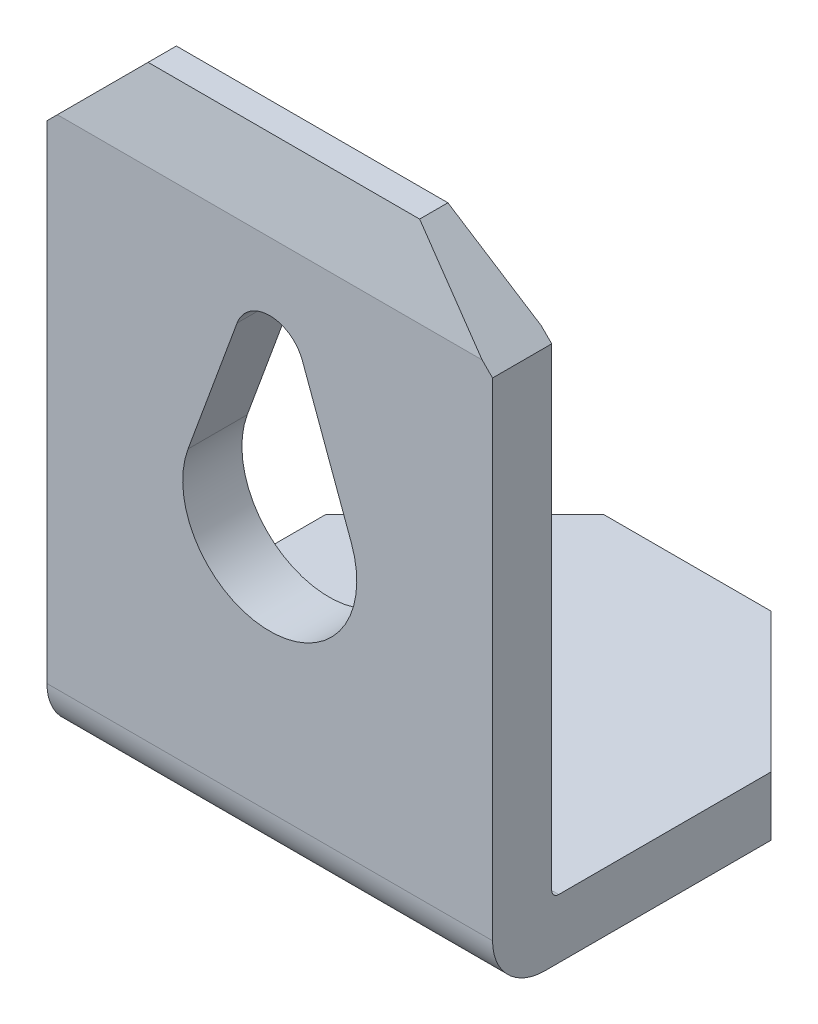
ISO-10303-21;
HEADER;
FILE_DESCRIPTION(('STEP AP214'),'2;1');
FILE_NAME('part.step','',(''),(''),'','','');
FILE_SCHEMA(('AUTOMOTIVE_DESIGN { 1 0 10303 214 1 1 1 1 }'));
ENDSEC;
DATA;
#1=APPLICATION_CONTEXT('core data for automotive mechanical design processes');
#2=APPLICATION_PROTOCOL_DEFINITION('international standard','automotive_design',2000,#1);
#3=PRODUCT_CONTEXT('',#1,'mechanical');
#4=PRODUCT('Part','Part','',(#3));
#5=PRODUCT_RELATED_PRODUCT_CATEGORY('part','',(#4));
#6=PRODUCT_DEFINITION_FORMATION('','',#4);
#7=PRODUCT_DEFINITION_CONTEXT('part definition',#1,'design');
#8=PRODUCT_DEFINITION('design','',#6,#7);
#9=PRODUCT_DEFINITION_SHAPE('','',#8);
#10=(LENGTH_UNIT() NAMED_UNIT(*) SI_UNIT(.MILLI.,.METRE.));
#11=(NAMED_UNIT(*) PLANE_ANGLE_UNIT() SI_UNIT($,.RADIAN.));
#12=(NAMED_UNIT(*) SI_UNIT($,.STERADIAN.) SOLID_ANGLE_UNIT());
#13=UNCERTAINTY_MEASURE_WITH_UNIT(LENGTH_MEASURE(1.E-05),#10,'distance_accuracy_value','');
#14=(GEOMETRIC_REPRESENTATION_CONTEXT(3) GLOBAL_UNCERTAINTY_ASSIGNED_CONTEXT((#13)) GLOBAL_UNIT_ASSIGNED_CONTEXT((#10,
#11,#12)) REPRESENTATION_CONTEXT('',''));
#15=CARTESIAN_POINT('',(0.,0.,0.));
#16=DIRECTION('',(0.,0.,1.));
#17=DIRECTION('',(1.,0.,0.));
#18=AXIS2_PLACEMENT_3D('',#15,#16,#17);
#19=CARTESIAN_POINT('',(6.4,7.05,0.));
#20=DIRECTION('',(0.,-0.214348018272916,0.976757353216485));
#21=DIRECTION('',(0.,-0.976757353216485,-0.214348018272916));
#22=AXIS2_PLACEMENT_3D('',#19,#20,#21);
#23=PLANE('',#22);
#24=DIRECTION('',(-1.,0.,0.));
#25=VECTOR('',#24,1.);
#26=CARTESIAN_POINT('',(6.4,7.05,0.));
#27=LINE('',#26,#25);
#28=CARTESIAN_POINT('',(6.25,7.05,0.));
#29=VERTEX_POINT('',#28);
#30=CARTESIAN_POINT('',(0.150000000000001,7.05,0.));
#31=VERTEX_POINT('',#30);
#32=EDGE_CURVE('E233',#29,#31,#27,.T.);
#33=ORIENTED_EDGE('',*,*,#32,.T.);
#34=DIRECTION('',(0.698744344369524,0.698744344369524,0.153338457091523));
#35=VECTOR('',#34,1.);
#36=CARTESIAN_POINT('',(3.20152286742747,10.1015228674275,0.669652372919065));
#37=LINE('',#36,#35);
#38=CARTESIAN_POINT('',(1.25,8.15,0.241393442622949));
#39=VERTEX_POINT('',#38);
#40=EDGE_CURVE('E208',#31,#39,#37,.T.);
#41=ORIENTED_EDGE('',*,*,#40,.T.);
#42=DIRECTION('',(-1.,0.,0.));
#43=VECTOR('',#42,1.);
#44=CARTESIAN_POINT('',(6.4,8.15,0.241393442622949));
#45=LINE('',#44,#43);
#46=CARTESIAN_POINT('',(5.15,8.15,0.241393442622949));
#47=VERTEX_POINT('',#46);
#48=EDGE_CURVE('E272',#47,#39,#45,.T.);
#49=ORIENTED_EDGE('',*,*,#48,.F.);
#50=DIRECTION('',(0.698744344369524,-0.698744344369524,-0.153338457091523));
#51=VECTOR('',#50,1.);
#52=CARTESIAN_POINT('',(6.32323654881826,6.97676345118174,-0.0160716569500576));
#53=LINE('',#52,#51);
#54=EDGE_CURVE('E214',#47,#29,#53,.T.);
#55=ORIENTED_EDGE('',*,*,#54,.T.);
#56=EDGE_LOOP('',(#33,#41,#49,#55));
#57=FACE_BOUND('',#56,.T.);
#58=ADVANCED_FACE('F32',(#57),#23,.F.);
#59=CARTESIAN_POINT('',(6.4,8.15,0.241393442622949));
#60=DIRECTION('',(0.,-1.,0.));
#61=DIRECTION('',(0.,0.,-1.));
#62=AXIS2_PLACEMENT_3D('',#59,#60,#61);
#63=PLANE('',#62);
#64=ORIENTED_EDGE('',*,*,#48,.T.);
#65=DIRECTION('',(0.,0.,1.));
#66=VECTOR('',#65,1.);
#67=CARTESIAN_POINT('',(1.25,8.15,-1.76776695296637));
#68=LINE('',#67,#66);
#69=CARTESIAN_POINT('',(1.25,8.15,0.647131147540979));
#70=VERTEX_POINT('',#69);
#71=EDGE_CURVE('E192',#39,#70,#68,.T.);
#72=ORIENTED_EDGE('',*,*,#71,.T.);
#73=DIRECTION('',(-1.,0.,0.));
#74=VECTOR('',#73,1.);
#75=CARTESIAN_POINT('',(6.4,8.15,0.647131147540979));
#76=LINE('',#75,#74);
#77=CARTESIAN_POINT('',(5.15,8.15,0.647131147540979));
#78=VERTEX_POINT('',#77);
#79=EDGE_CURVE('E269',#78,#70,#76,.T.);
#80=ORIENTED_EDGE('',*,*,#79,.F.);
#81=DIRECTION('',(0.,0.,1.));
#82=VECTOR('',#81,1.);
#83=CARTESIAN_POINT('',(5.15,8.15,-1.76776695296637));
#84=LINE('',#83,#82);
#85=EDGE_CURVE('E200',#47,#78,#84,.T.);
#86=ORIENTED_EDGE('',*,*,#85,.F.);
#87=EDGE_LOOP('',(#64,#72,#80,#86));
#88=FACE_BOUND('',#87,.T.);
#89=ADVANCED_FACE('F345',(#88),#63,.F.);
#90=CARTESIAN_POINT('',(6.4,8.15,0.647131147540979));
#91=DIRECTION('',(0.,-0.181367589437408,-0.983415373838372));
#92=DIRECTION('',(0.,0.983415373838372,-0.181367589437408));
#93=AXIS2_PLACEMENT_3D('',#90,#91,#92);
#94=PLANE('',#93);
#95=ORIENTED_EDGE('',*,*,#79,.T.);
#96=DIRECTION('',(-0.70116968993079,-0.70116968993079,0.12931408215937));
#97=VECTOR('',#96,1.);
#98=CARTESIAN_POINT('',(3.78194051049985,10.6819405104998,0.180174905850425));
#99=LINE('',#98,#97);
#100=CARTESIAN_POINT('',(0.15,7.05,0.849999999999999));
#101=VERTEX_POINT('',#100);
#102=EDGE_CURVE('E198',#70,#101,#99,.T.);
#103=ORIENTED_EDGE('',*,*,#102,.T.);
#104=DIRECTION('',(-1.,0.,0.));
#105=VECTOR('',#104,1.);
#106=CARTESIAN_POINT('',(6.4,7.05,0.85));
#107=LINE('',#106,#105);
#108=CARTESIAN_POINT('',(6.25,7.05,0.849999999999999));
#109=VERTEX_POINT('',#108);
#110=EDGE_CURVE('E266',#109,#101,#107,.T.);
#111=ORIENTED_EDGE('',*,*,#110,.F.);
#112=DIRECTION('',(-0.70116968993079,0.70116968993079,-0.12931408215937));
#113=VECTOR('',#112,1.);
#114=CARTESIAN_POINT('',(5.76454866759705,7.53545133240295,0.760470041155192));
#115=LINE('',#114,#113);
#116=EDGE_CURVE('E211',#109,#78,#115,.T.);
#117=ORIENTED_EDGE('',*,*,#116,.T.);
#118=EDGE_LOOP('',(#95,#103,#111,#117));
#119=FACE_BOUND('',#118,.T.);
#120=ADVANCED_FACE('F342',(#119),#94,.F.);
#121=CARTESIAN_POINT('',(6.4,7.05,0.85));
#122=DIRECTION('',(0.,0.,-1.));
#123=DIRECTION('',(0.,1.,0.));
#124=AXIS2_PLACEMENT_3D('',#121,#122,#123);
#125=PLANE('',#124);
#126=DIRECTION('',(-0.344583937553277,-0.938755511291561,0.));
#127=VECTOR('',#126,1.);
#128=CARTESIAN_POINT('',(2.73062224435422,5.74882986931079,0.849999999999999));
#129=LINE('',#128,#127);
#130=CARTESIAN_POINT('',(2.73062224435422,5.74882986931079,0.85));
#131=VERTEX_POINT('',#130);
#132=CARTESIAN_POINT('',(2.02655561088555,3.83072992194159,0.849999999999999));
#133=VERTEX_POINT('',#132);
#134=EDGE_CURVE('E168',#131,#133,#129,.T.);
#135=ORIENTED_EDGE('',*,*,#134,.F.);
#136=CARTESIAN_POINT('',(3.2,5.57653790053415,0.849999999999999));
#137=DIRECTION('',(0.,0.,1.));
#138=DIRECTION('',(1.,0.,0.));
#139=AXIS2_PLACEMENT_3D('',#136,#137,#138);
#140=CIRCLE('',#139,0.5);
#141=CARTESIAN_POINT('',(3.66963395220552,5.74813029819741,0.849999999999999));
#142=VERTEX_POINT('',#141);
#143=EDGE_CURVE('E47',#142,#131,#140,.T.);
#144=ORIENTED_EDGE('',*,*,#143,.F.);
#145=DIRECTION('',(-0.344584192655148,0.938755417652649,0.));
#146=VECTOR('',#145,1.);
#147=CARTESIAN_POINT('',(3.66963395220552,5.74813029819741,0.849999999999999));
#148=LINE('',#147,#146);
#149=CARTESIAN_POINT('',(4.37344427206581,3.83073024081893,0.849999999999999));
#150=VERTEX_POINT('',#149);
#151=EDGE_CURVE('E175',#150,#142,#148,.T.);
#152=ORIENTED_EDGE('',*,*,#151,.F.);
#153=CARTESIAN_POINT('',(3.2,3.4,0.849999999999999));
#154=DIRECTION('',(0.,0.,1.));
#155=DIRECTION('',(1.,0.,0.));
#156=AXIS2_PLACEMENT_3D('',#153,#154,#155);
#157=CIRCLE('',#156,1.25);
#158=EDGE_CURVE('E159',#133,#150,#157,.T.);
#159=ORIENTED_EDGE('',*,*,#158,.F.);
#160=EDGE_LOOP('',(#135,#144,#152,#159));
#161=FACE_BOUND('',#160,.T.);
#162=ORIENTED_EDGE('',*,*,#110,.T.);
#163=DIRECTION('',(0.707106781186547,0.707106781186548,0.));
#164=VECTOR('',#163,1.);
#165=CARTESIAN_POINT('',(0.,6.9,0.849999999999999));
#166=LINE('',#165,#164);
#167=CARTESIAN_POINT('',(0.,6.9,0.849999999999999));
#168=VERTEX_POINT('',#167);
#169=EDGE_CURVE('E188',#168,#101,#166,.T.);
#170=ORIENTED_EDGE('',*,*,#169,.F.);
#171=DIRECTION('',(0.,-1.,0.));
#172=VECTOR('',#171,1.);
#173=CARTESIAN_POINT('',(0.,7.05,0.85));
#174=LINE('',#173,#172);
#175=CARTESIAN_POINT('',(0.,-0.0999999999999957,0.849999999999999));
#176=VERTEX_POINT('',#175);
#177=EDGE_CURVE('E217',#168,#176,#174,.T.);
#178=ORIENTED_EDGE('',*,*,#177,.T.);
#179=DIRECTION('',(-1.,0.,0.));
#180=VECTOR('',#179,1.);
#181=CARTESIAN_POINT('',(6.4,-0.0999999999999957,0.849999999999999));
#182=LINE('',#181,#180);
#183=CARTESIAN_POINT('',(6.4,-0.0999999999999957,0.849999999999999));
#184=VERTEX_POINT('',#183);
#185=EDGE_CURVE('E263',#184,#176,#182,.T.);
#186=ORIENTED_EDGE('',*,*,#185,.F.);
#187=DIRECTION('',(0.,-1.,0.));
#188=VECTOR('',#187,1.);
#189=CARTESIAN_POINT('',(6.4,7.05,0.85));
#190=LINE('',#189,#188);
#191=CARTESIAN_POINT('',(6.4,6.9,0.85));
#192=VERTEX_POINT('',#191);
#193=EDGE_CURVE('E218',#192,#184,#190,.T.);
#194=ORIENTED_EDGE('',*,*,#193,.F.);
#195=DIRECTION('',(0.707106781186548,-0.707106781186548,0.));
#196=VECTOR('',#195,1.);
#197=CARTESIAN_POINT('',(5.15,8.15,0.849999999999999));
#198=LINE('',#197,#196);
#199=EDGE_CURVE('E186',#109,#192,#198,.T.);
#200=ORIENTED_EDGE('',*,*,#199,.F.);
#201=EDGE_LOOP('',(#162,#170,#178,#186,#194,#200));
#202=FACE_BOUND('',#201,.T.);
#203=ADVANCED_FACE('F172',(#161,#202),#125,.F.);
#204=CARTESIAN_POINT('',(6.4,-0.100000000000001,0.099999999999999));
#205=DIRECTION('',(-1.,0.,0.));
#206=DIRECTION('',(0.,0.,1.));
#207=AXIS2_PLACEMENT_3D('',#204,#205,#206);
#208=CYLINDRICAL_SURFACE('',#207,0.75);
#209=CARTESIAN_POINT('',(0.,-0.100000000000001,0.099999999999999));
#210=DIRECTION('',(1.,0.,0.));
#211=DIRECTION('',(0.,0.,-1.));
#212=AXIS2_PLACEMENT_3D('',#209,#210,#211);
#213=CIRCLE('',#212,0.75);
#214=CARTESIAN_POINT('',(0.,-0.850000000000001,0.0999999999999936));
#215=VERTEX_POINT('',#214);
#216=EDGE_CURVE('E235',#176,#215,#213,.T.);
#217=ORIENTED_EDGE('',*,*,#216,.T.);
#218=DIRECTION('',(-1.,0.,0.));
#219=VECTOR('',#218,1.);
#220=CARTESIAN_POINT('',(6.4,-0.850000000000001,0.0999999999999936));
#221=LINE('',#220,#219);
#222=CARTESIAN_POINT('',(6.4,-0.850000000000001,0.0999999999999936));
#223=VERTEX_POINT('',#222);
#224=EDGE_CURVE('E260',#223,#215,#221,.T.);
#225=ORIENTED_EDGE('',*,*,#224,.F.);
#226=CARTESIAN_POINT('',(6.4,-0.100000000000001,0.099999999999999));
#227=DIRECTION('',(1.,0.,0.));
#228=DIRECTION('',(0.,0.,-1.));
#229=AXIS2_PLACEMENT_3D('',#226,#227,#228);
#230=CIRCLE('',#229,0.75);
#231=EDGE_CURVE('E220',#184,#223,#230,.T.);
#232=ORIENTED_EDGE('',*,*,#231,.F.);
#233=ORIENTED_EDGE('',*,*,#185,.T.);
#234=EDGE_LOOP('',(#217,#225,#232,#233));
#235=FACE_BOUND('',#234,.T.);
#236=ADVANCED_FACE('F338',(#235),#208,.T.);
#237=CARTESIAN_POINT('',(6.4,-0.850000000000001,0.0999999999999936));
#238=DIRECTION('',(0.,1.,0.));
#239=DIRECTION('',(0.,0.,1.));
#240=AXIS2_PLACEMENT_3D('',#237,#238,#239);
#241=PLANE('',#240);
#242=DIRECTION('',(-1.,0.,0.));
#243=VECTOR('',#242,1.);
#244=CARTESIAN_POINT('',(6.4,-0.850000000000001,-5.15));
#245=LINE('',#244,#243);
#246=CARTESIAN_POINT('',(4.39999999999999,-0.850000000000001,-5.15));
#247=VERTEX_POINT('',#246);
#248=CARTESIAN_POINT('',(2.,-0.850000000000001,-5.15));
#249=VERTEX_POINT('',#248);
#250=EDGE_CURVE('E257',#247,#249,#245,.T.);
#251=ORIENTED_EDGE('',*,*,#250,.F.);
#252=DIRECTION('',(0.707106781186549,0.,0.707106781186546));
#253=VECTOR('',#252,1.);
#254=CARTESIAN_POINT('',(6.4,-0.850000000000001,-3.15));
#255=LINE('',#254,#253);
#256=CARTESIAN_POINT('',(6.4,-0.850000000000001,-3.15));
#257=VERTEX_POINT('',#256);
#258=EDGE_CURVE('E40',#247,#257,#255,.T.);
#259=ORIENTED_EDGE('',*,*,#258,.T.);
#260=DIRECTION('',(0.,0.,-1.));
#261=VECTOR('',#260,1.);
#262=CARTESIAN_POINT('',(6.4,-0.850000000000001,0.0999999999999936));
#263=LINE('',#262,#261);
#264=EDGE_CURVE('E223',#223,#257,#263,.T.);
#265=ORIENTED_EDGE('',*,*,#264,.F.);
#266=ORIENTED_EDGE('',*,*,#224,.T.);
#267=DIRECTION('',(0.,0.,-1.));
#268=VECTOR('',#267,1.);
#269=CARTESIAN_POINT('',(0.,-0.850000000000001,0.0999999999999936));
#270=LINE('',#269,#268);
#271=CARTESIAN_POINT('',(0.,-0.850000000000001,-3.15));
#272=VERTEX_POINT('',#271);
#273=EDGE_CURVE('E237',#215,#272,#270,.T.);
#274=ORIENTED_EDGE('',*,*,#273,.T.);
#275=DIRECTION('',(-0.707106781186547,0.,0.707106781186549));
#276=VECTOR('',#275,1.);
#277=CARTESIAN_POINT('',(2.,-0.850000000000001,-5.15));
#278=LINE('',#277,#276);
#279=EDGE_CURVE('E287',#272,#249,#278,.F.);
#280=ORIENTED_EDGE('',*,*,#279,.T.);
#281=EDGE_LOOP('',(#251,#259,#265,#266,#274,#280));
#282=FACE_BOUND('',#281,.T.);
#283=ADVANCED_FACE('F292',(#282),#241,.F.);
#284=CARTESIAN_POINT('',(6.4,-0.850000000000001,-5.15));
#285=DIRECTION('',(0.,0.,1.));
#286=DIRECTION('',(1.,0.,0.));
#287=AXIS2_PLACEMENT_3D('',#284,#285,#286);
#288=PLANE('',#287);
#289=DIRECTION('',(-1.,0.,0.));
#290=VECTOR('',#289,1.);
#291=CARTESIAN_POINT('',(6.4,0.,-5.15));
#292=LINE('',#291,#290);
#293=CARTESIAN_POINT('',(4.39999999999999,0.,-5.15));
#294=VERTEX_POINT('',#293);
#295=CARTESIAN_POINT('',(2.,0.,-5.15));
#296=VERTEX_POINT('',#295);
#297=EDGE_CURVE('E254',#294,#296,#292,.T.);
#298=ORIENTED_EDGE('',*,*,#297,.F.);
#299=DIRECTION('',(0.,-1.,0.));
#300=VECTOR('',#299,1.);
#301=CARTESIAN_POINT('',(4.39999999999999,-0.850000000000001,-5.15));
#302=LINE('',#301,#300);
#303=EDGE_CURVE('E285',#294,#247,#302,.T.);
#304=ORIENTED_EDGE('',*,*,#303,.T.);
#305=ORIENTED_EDGE('',*,*,#250,.T.);
#306=DIRECTION('',(0.,1.,0.));
#307=VECTOR('',#306,1.);
#308=CARTESIAN_POINT('',(2.,-0.850000000000001,-5.15));
#309=LINE('',#308,#307);
#310=EDGE_CURVE('E282',#249,#296,#309,.T.);
#311=ORIENTED_EDGE('',*,*,#310,.T.);
#312=EDGE_LOOP('',(#298,#304,#305,#311));
#313=FACE_BOUND('',#312,.T.);
#314=ADVANCED_FACE('F307',(#313),#288,.F.);
#315=CARTESIAN_POINT('',(6.4,0.,-5.15));
#316=DIRECTION('',(0.,-1.,0.));
#317=DIRECTION('',(0.,0.,-1.));
#318=AXIS2_PLACEMENT_3D('',#315,#316,#317);
#319=PLANE('',#318);
#320=DIRECTION('',(0.,0.,1.));
#321=VECTOR('',#320,1.);
#322=CARTESIAN_POINT('',(6.4,0.,-5.15));
#323=LINE('',#322,#321);
#324=CARTESIAN_POINT('',(6.4,0.,-3.15));
#325=VERTEX_POINT('',#324);
#326=CARTESIAN_POINT('',(6.4,0.,-0.100000000000001));
#327=VERTEX_POINT('',#326);
#328=EDGE_CURVE('E226',#325,#327,#323,.T.);
#329=ORIENTED_EDGE('',*,*,#328,.F.);
#330=DIRECTION('',(-0.707106781186549,0.,-0.707106781186546));
#331=VECTOR('',#330,1.);
#332=CARTESIAN_POINT('',(6.4,0.,-3.15));
#333=LINE('',#332,#331);
#334=EDGE_CURVE('E280',#325,#294,#333,.T.);
#335=ORIENTED_EDGE('',*,*,#334,.T.);
#336=ORIENTED_EDGE('',*,*,#297,.T.);
#337=DIRECTION('',(0.707106781186547,0.,-0.707106781186549));
#338=VECTOR('',#337,1.);
#339=CARTESIAN_POINT('',(2.,0.,-5.15));
#340=LINE('',#339,#338);
#341=CARTESIAN_POINT('',(0.,0.,-3.15));
#342=VERTEX_POINT('',#341);
#343=EDGE_CURVE('E278',#296,#342,#340,.F.);
#344=ORIENTED_EDGE('',*,*,#343,.T.);
#345=DIRECTION('',(0.,0.,1.));
#346=VECTOR('',#345,1.);
#347=CARTESIAN_POINT('',(0.,0.,-5.15));
#348=LINE('',#347,#346);
#349=CARTESIAN_POINT('',(0.,0.,-0.100000000000001));
#350=VERTEX_POINT('',#349);
#351=EDGE_CURVE('E240',#342,#350,#348,.T.);
#352=ORIENTED_EDGE('',*,*,#351,.T.);
#353=DIRECTION('',(-1.,0.,0.));
#354=VECTOR('',#353,1.);
#355=CARTESIAN_POINT('',(6.4,0.,-0.100000000000001));
#356=LINE('',#355,#354);
#357=EDGE_CURVE('E251',#327,#350,#356,.T.);
#358=ORIENTED_EDGE('',*,*,#357,.F.);
#359=EDGE_LOOP('',(#329,#335,#336,#344,#352,#358));
#360=FACE_BOUND('',#359,.T.);
#361=ADVANCED_FACE('F304',(#360),#319,.F.);
#362=CARTESIAN_POINT('',(6.4,0.1,-0.1));
#363=DIRECTION('',(-1.,0.,0.));
#364=DIRECTION('',(0.,0.,1.));
#365=AXIS2_PLACEMENT_3D('',#362,#363,#364);
#366=CYLINDRICAL_SURFACE('',#365,0.1);
#367=CARTESIAN_POINT('',(0.,0.1,-0.1));
#368=DIRECTION('',(-1.,0.,0.));
#369=DIRECTION('',(0.,0.,-1.));
#370=AXIS2_PLACEMENT_3D('',#367,#368,#369);
#371=CIRCLE('',#370,0.1);
#372=CARTESIAN_POINT('',(0.,0.100000000000001,0.));
#373=VERTEX_POINT('',#372);
#374=EDGE_CURVE('E242',#350,#373,#371,.T.);
#375=ORIENTED_EDGE('',*,*,#374,.T.);
#376=DIRECTION('',(-1.,0.,0.));
#377=VECTOR('',#376,1.);
#378=CARTESIAN_POINT('',(6.4,0.100000000000001,0.));
#379=LINE('',#378,#377);
#380=CARTESIAN_POINT('',(6.4,0.100000000000001,0.));
#381=VERTEX_POINT('',#380);
#382=EDGE_CURVE('E248',#381,#373,#379,.T.);
#383=ORIENTED_EDGE('',*,*,#382,.F.);
#384=CARTESIAN_POINT('',(6.4,0.1,-0.1));
#385=DIRECTION('',(-1.,0.,0.));
#386=DIRECTION('',(0.,0.,-1.));
#387=AXIS2_PLACEMENT_3D('',#384,#385,#386);
#388=CIRCLE('',#387,0.1);
#389=EDGE_CURVE('E228',#327,#381,#388,.T.);
#390=ORIENTED_EDGE('',*,*,#389,.F.);
#391=ORIENTED_EDGE('',*,*,#357,.T.);
#392=EDGE_LOOP('',(#375,#383,#390,#391));
#393=FACE_BOUND('',#392,.T.);
#394=ADVANCED_FACE('F322',(#393),#366,.F.);
#395=CARTESIAN_POINT('',(6.4,0.100000000000001,0.));
#396=DIRECTION('',(0.,0.,1.));
#397=DIRECTION('',(0.,-1.,0.));
#398=AXIS2_PLACEMENT_3D('',#395,#396,#397);
#399=PLANE('',#398);
#400=DIRECTION('',(0.344584192655148,-0.938755417652649,0.));
#401=VECTOR('',#400,1.);
#402=CARTESIAN_POINT('',(3.66963395220552,5.74813029819741,0.));
#403=LINE('',#402,#401);
#404=CARTESIAN_POINT('',(3.66963395220552,5.74813029819741,0.));
#405=VERTEX_POINT('',#404);
#406=CARTESIAN_POINT('',(4.37344427206581,3.83073024081893,0.));
#407=VERTEX_POINT('',#406);
#408=EDGE_CURVE('E482',#405,#407,#403,.T.);
#409=ORIENTED_EDGE('',*,*,#408,.F.);
#410=CARTESIAN_POINT('',(3.2,5.57653790053415,0.));
#411=DIRECTION('',(0.,0.,1.));
#412=DIRECTION('',(0.,-1.,0.));
#413=AXIS2_PLACEMENT_3D('',#410,#411,#412);
#414=CIRCLE('',#413,0.5);
#415=CARTESIAN_POINT('',(2.73062224435422,5.74882986931079,0.));
#416=VERTEX_POINT('',#415);
#417=EDGE_CURVE('E187',#416,#405,#414,.F.);
#418=ORIENTED_EDGE('',*,*,#417,.F.);
#419=DIRECTION('',(0.344583937553277,0.938755511291561,0.));
#420=VECTOR('',#419,1.);
#421=CARTESIAN_POINT('',(2.73062224435422,5.74882986931079,0.));
#422=LINE('',#421,#420);
#423=CARTESIAN_POINT('',(2.02655561088555,3.83072992194159,0.));
#424=VERTEX_POINT('',#423);
#425=EDGE_CURVE('E184',#424,#416,#422,.T.);
#426=ORIENTED_EDGE('',*,*,#425,.F.);
#427=CARTESIAN_POINT('',(3.2,3.4,0.));
#428=DIRECTION('',(0.,0.,1.));
#429=DIRECTION('',(0.,-1.,0.));
#430=AXIS2_PLACEMENT_3D('',#427,#428,#429);
#431=CIRCLE('',#430,1.25);
#432=EDGE_CURVE('E162',#407,#424,#431,.F.);
#433=ORIENTED_EDGE('',*,*,#432,.F.);
#434=EDGE_LOOP('',(#409,#418,#426,#433));
#435=FACE_BOUND('',#434,.T.);
#436=DIRECTION('',(0.,1.,0.));
#437=VECTOR('',#436,1.);
#438=CARTESIAN_POINT('',(0.,0.100000000000001,0.));
#439=LINE('',#438,#437);
#440=CARTESIAN_POINT('',(0.,6.9,0.));
#441=VERTEX_POINT('',#440);
#442=EDGE_CURVE('E221',#373,#441,#439,.T.);
#443=ORIENTED_EDGE('',*,*,#442,.T.);
#444=DIRECTION('',(-0.707106781186548,-0.707106781186548,0.));
#445=VECTOR('',#444,1.);
#446=CARTESIAN_POINT('',(0.,6.9,0.));
#447=LINE('',#446,#445);
#448=EDGE_CURVE('E195',#31,#441,#447,.T.);
#449=ORIENTED_EDGE('',*,*,#448,.F.);
#450=ORIENTED_EDGE('',*,*,#32,.F.);
#451=DIRECTION('',(-0.707106781186548,0.707106781186548,0.));
#452=VECTOR('',#451,1.);
#453=CARTESIAN_POINT('',(5.15,8.15,0.));
#454=LINE('',#453,#452);
#455=CARTESIAN_POINT('',(6.4,6.9,0.));
#456=VERTEX_POINT('',#455);
#457=EDGE_CURVE('E191',#456,#29,#454,.T.);
#458=ORIENTED_EDGE('',*,*,#457,.F.);
#459=DIRECTION('',(0.,1.,0.));
#460=VECTOR('',#459,1.);
#461=CARTESIAN_POINT('',(6.4,0.100000000000001,0.));
#462=LINE('',#461,#460);
#463=EDGE_CURVE('E230',#381,#456,#462,.T.);
#464=ORIENTED_EDGE('',*,*,#463,.F.);
#465=ORIENTED_EDGE('',*,*,#382,.T.);
#466=EDGE_LOOP('',(#443,#449,#450,#458,#464,#465));
#467=FACE_BOUND('',#466,.T.);
#468=ADVANCED_FACE('F326',(#435,#467),#399,.F.);
#469=CARTESIAN_POINT('',(6.4,-0.100000000000001,0.099999999999999));
#470=DIRECTION('',(1.,0.,0.));
#471=DIRECTION('',(0.,0.,-1.));
#472=AXIS2_PLACEMENT_3D('',#469,#470,#471);
#473=PLANE('',#472);
#474=DIRECTION('',(0.,0.,1.));
#475=VECTOR('',#474,1.);
#476=CARTESIAN_POINT('',(6.4,6.9,-1.76776695296637));
#477=LINE('',#476,#475);
#478=EDGE_CURVE('E201',#456,#192,#477,.T.);
#479=ORIENTED_EDGE('',*,*,#478,.T.);
#480=ORIENTED_EDGE('',*,*,#193,.T.);
#481=ORIENTED_EDGE('',*,*,#231,.T.);
#482=ORIENTED_EDGE('',*,*,#264,.T.);
#483=DIRECTION('',(0.,1.,0.));
#484=VECTOR('',#483,1.);
#485=CARTESIAN_POINT('',(6.4,0.,-3.15));
#486=LINE('',#485,#484);
#487=EDGE_CURVE('E275',#257,#325,#486,.T.);
#488=ORIENTED_EDGE('',*,*,#487,.T.);
#489=ORIENTED_EDGE('',*,*,#328,.T.);
#490=ORIENTED_EDGE('',*,*,#389,.T.);
#491=ORIENTED_EDGE('',*,*,#463,.T.);
#492=EDGE_LOOP('',(#479,#480,#481,#482,#488,#489,#490,#491));
#493=FACE_BOUND('',#492,.T.);
#494=ADVANCED_FACE('F297',(#493),#473,.T.);
#495=CARTESIAN_POINT('',(0.,-0.100000000000001,0.099999999999999));
#496=DIRECTION('',(1.,0.,0.));
#497=DIRECTION('',(0.,0.,-1.));
#498=AXIS2_PLACEMENT_3D('',#495,#496,#497);
#499=PLANE('',#498);
#500=ORIENTED_EDGE('',*,*,#177,.F.);
#501=DIRECTION('',(0.,0.,1.));
#502=VECTOR('',#501,1.);
#503=CARTESIAN_POINT('',(0.,6.9,-1.76776695296637));
#504=LINE('',#503,#502);
#505=EDGE_CURVE('E190',#441,#168,#504,.T.);
#506=ORIENTED_EDGE('',*,*,#505,.F.);
#507=ORIENTED_EDGE('',*,*,#442,.F.);
#508=ORIENTED_EDGE('',*,*,#374,.F.);
#509=ORIENTED_EDGE('',*,*,#351,.F.);
#510=DIRECTION('',(0.,-1.,0.));
#511=VECTOR('',#510,1.);
#512=CARTESIAN_POINT('',(0.,-0.100000000000001,-3.15));
#513=LINE('',#512,#511);
#514=EDGE_CURVE('E11',#342,#272,#513,.T.);
#515=ORIENTED_EDGE('',*,*,#514,.T.);
#516=ORIENTED_EDGE('',*,*,#273,.F.);
#517=ORIENTED_EDGE('',*,*,#216,.F.);
#518=EDGE_LOOP('',(#500,#506,#507,#508,#509,#515,#516,#517));
#519=FACE_BOUND('',#518,.T.);
#520=ADVANCED_FACE('F316',(#519),#499,.F.);
#521=CARTESIAN_POINT('',(6.4,-0.100000000000001,-3.15));
#522=DIRECTION('',(0.707106781186546,0.,-0.707106781186549));
#523=DIRECTION('',(0.,-1.,0.));
#524=AXIS2_PLACEMENT_3D('',#521,#522,#523);
#525=PLANE('',#524);
#526=ORIENTED_EDGE('',*,*,#258,.F.);
#527=ORIENTED_EDGE('',*,*,#303,.F.);
#528=ORIENTED_EDGE('',*,*,#334,.F.);
#529=ORIENTED_EDGE('',*,*,#487,.F.);
#530=EDGE_LOOP('',(#526,#527,#528,#529));
#531=FACE_BOUND('',#530,.T.);
#532=ADVANCED_FACE('F301',(#531),#525,.T.);
#533=CARTESIAN_POINT('',(2.,-0.850000000000001,-5.15));
#534=DIRECTION('',(0.707106781186549,0.,0.707106781186547));
#535=DIRECTION('',(0.,1.,0.));
#536=AXIS2_PLACEMENT_3D('',#533,#534,#535);
#537=PLANE('',#536);
#538=ORIENTED_EDGE('',*,*,#279,.F.);
#539=ORIENTED_EDGE('',*,*,#514,.F.);
#540=ORIENTED_EDGE('',*,*,#343,.F.);
#541=ORIENTED_EDGE('',*,*,#310,.F.);
#542=EDGE_LOOP('',(#538,#539,#540,#541));
#543=FACE_BOUND('',#542,.T.);
#544=ADVANCED_FACE('F34',(#543),#537,.F.);
#545=CARTESIAN_POINT('',(0.,6.9,-1.76776695296637));
#546=DIRECTION('',(0.707106781186548,-0.707106781186548,0.));
#547=DIRECTION('',(0.707106781186548,0.707106781186548,0.));
#548=AXIS2_PLACEMENT_3D('',#545,#546,#547);
#549=PLANE('',#548);
#550=ORIENTED_EDGE('',*,*,#448,.T.);
#551=ORIENTED_EDGE('',*,*,#505,.T.);
#552=ORIENTED_EDGE('',*,*,#169,.T.);
#553=ORIENTED_EDGE('',*,*,#102,.F.);
#554=ORIENTED_EDGE('',*,*,#71,.F.);
#555=ORIENTED_EDGE('',*,*,#40,.F.);
#556=EDGE_LOOP('',(#550,#551,#552,#553,#554,#555));
#557=FACE_BOUND('',#556,.T.);
#558=ADVANCED_FACE('F340',(#557),#549,.F.);
#559=CARTESIAN_POINT('',(5.15,8.15,-1.76776695296637));
#560=DIRECTION('',(-0.707106781186547,-0.707106781186547,0.));
#561=DIRECTION('',(0.707106781186548,-0.707106781186548,0.));
#562=AXIS2_PLACEMENT_3D('',#559,#560,#561);
#563=PLANE('',#562);
#564=ORIENTED_EDGE('',*,*,#85,.T.);
#565=ORIENTED_EDGE('',*,*,#116,.F.);
#566=ORIENTED_EDGE('',*,*,#199,.T.);
#567=ORIENTED_EDGE('',*,*,#478,.F.);
#568=ORIENTED_EDGE('',*,*,#457,.T.);
#569=ORIENTED_EDGE('',*,*,#54,.F.);
#570=EDGE_LOOP('',(#564,#565,#566,#567,#568,#569));
#571=FACE_BOUND('',#570,.T.);
#572=ADVANCED_FACE('F349',(#571),#563,.F.);
#573=CARTESIAN_POINT('',(3.2,5.57653790053415,-4.65485766531385));
#574=DIRECTION('',(0.,0.,1.));
#575=DIRECTION('',(1.,0.,0.));
#576=AXIS2_PLACEMENT_3D('',#573,#574,#575);
#577=CYLINDRICAL_SURFACE('',#576,0.5);
#578=ORIENTED_EDGE('',*,*,#417,.T.);
#579=DIRECTION('',(0.,0.,1.));
#580=VECTOR('',#579,1.);
#581=CARTESIAN_POINT('',(3.66963395220552,5.74813029819741,-4.65485766531385));
#582=LINE('',#581,#580);
#583=EDGE_CURVE('E180',#405,#142,#582,.T.);
#584=ORIENTED_EDGE('',*,*,#583,.T.);
#585=ORIENTED_EDGE('',*,*,#143,.T.);
#586=DIRECTION('',(0.,0.,1.));
#587=VECTOR('',#586,1.);
#588=CARTESIAN_POINT('',(2.73062224435422,5.74882986931079,-4.65485766531385));
#589=LINE('',#588,#587);
#590=EDGE_CURVE('E165',#416,#131,#589,.T.);
#591=ORIENTED_EDGE('',*,*,#590,.F.);
#592=EDGE_LOOP('',(#578,#584,#585,#591));
#593=FACE_BOUND('',#592,.T.);
#594=ADVANCED_FACE('F351',(#593),#577,.F.);
#595=CARTESIAN_POINT('',(3.66963395220552,5.74813029819741,-4.65485766531385));
#596=DIRECTION('',(0.938755417652649,0.344584192655148,0.));
#597=DIRECTION('',(-0.344584192655148,0.938755417652649,0.));
#598=AXIS2_PLACEMENT_3D('',#595,#596,#597);
#599=PLANE('',#598);
#600=ORIENTED_EDGE('',*,*,#408,.T.);
#601=DIRECTION('',(0.,0.,1.));
#602=VECTOR('',#601,1.);
#603=CARTESIAN_POINT('',(4.37344427206581,3.83073024081893,-4.65485766531385));
#604=LINE('',#603,#602);
#605=EDGE_CURVE('E164',#407,#150,#604,.T.);
#606=ORIENTED_EDGE('',*,*,#605,.T.);
#607=ORIENTED_EDGE('',*,*,#151,.T.);
#608=ORIENTED_EDGE('',*,*,#583,.F.);
#609=EDGE_LOOP('',(#600,#606,#607,#608));
#610=FACE_BOUND('',#609,.T.);
#611=ADVANCED_FACE('F357',(#610),#599,.F.);
#612=CARTESIAN_POINT('',(3.2,3.4,-4.65485766531385));
#613=DIRECTION('',(0.,0.,1.));
#614=DIRECTION('',(1.,0.,0.));
#615=AXIS2_PLACEMENT_3D('',#612,#613,#614);
#616=CYLINDRICAL_SURFACE('',#615,1.25);
#617=ORIENTED_EDGE('',*,*,#432,.T.);
#618=DIRECTION('',(0.,0.,1.));
#619=VECTOR('',#618,1.);
#620=CARTESIAN_POINT('',(2.02655561088555,3.83072992194159,-4.65485766531385));
#621=LINE('',#620,#619);
#622=EDGE_CURVE('E55',#424,#133,#621,.T.);
#623=ORIENTED_EDGE('',*,*,#622,.T.);
#624=ORIENTED_EDGE('',*,*,#158,.T.);
#625=ORIENTED_EDGE('',*,*,#605,.F.);
#626=EDGE_LOOP('',(#617,#623,#624,#625));
#627=FACE_BOUND('',#626,.T.);
#628=ADVANCED_FACE('F156',(#627),#616,.F.);
#629=CARTESIAN_POINT('',(2.73062224435422,5.74882986931079,-4.65485766531385));
#630=DIRECTION('',(-0.938755511291561,0.344583937553277,0.));
#631=DIRECTION('',(-0.344583937553277,-0.938755511291561,0.));
#632=AXIS2_PLACEMENT_3D('',#629,#630,#631);
#633=PLANE('',#632);
#634=ORIENTED_EDGE('',*,*,#425,.T.);
#635=ORIENTED_EDGE('',*,*,#590,.T.);
#636=ORIENTED_EDGE('',*,*,#134,.T.);
#637=ORIENTED_EDGE('',*,*,#622,.F.);
#638=EDGE_LOOP('',(#634,#635,#636,#637));
#639=FACE_BOUND('',#638,.T.);
#640=ADVANCED_FACE('F169',(#639),#633,.F.);
#641=CLOSED_SHELL('',(#58,#89,#120,#203,#236,#283,#314,#361,#394,#468,#494,#520,#532,#544,#558,
#572,#594,#611,#628,#640));
#642=MANIFOLD_SOLID_BREP('B2',#641);
#643=ADVANCED_BREP_SHAPE_REPRESENTATION('',(#18,#642),#14);
#644=SHAPE_DEFINITION_REPRESENTATION(#9,#643);
ENDSEC;
END-ISO-10303-21;
